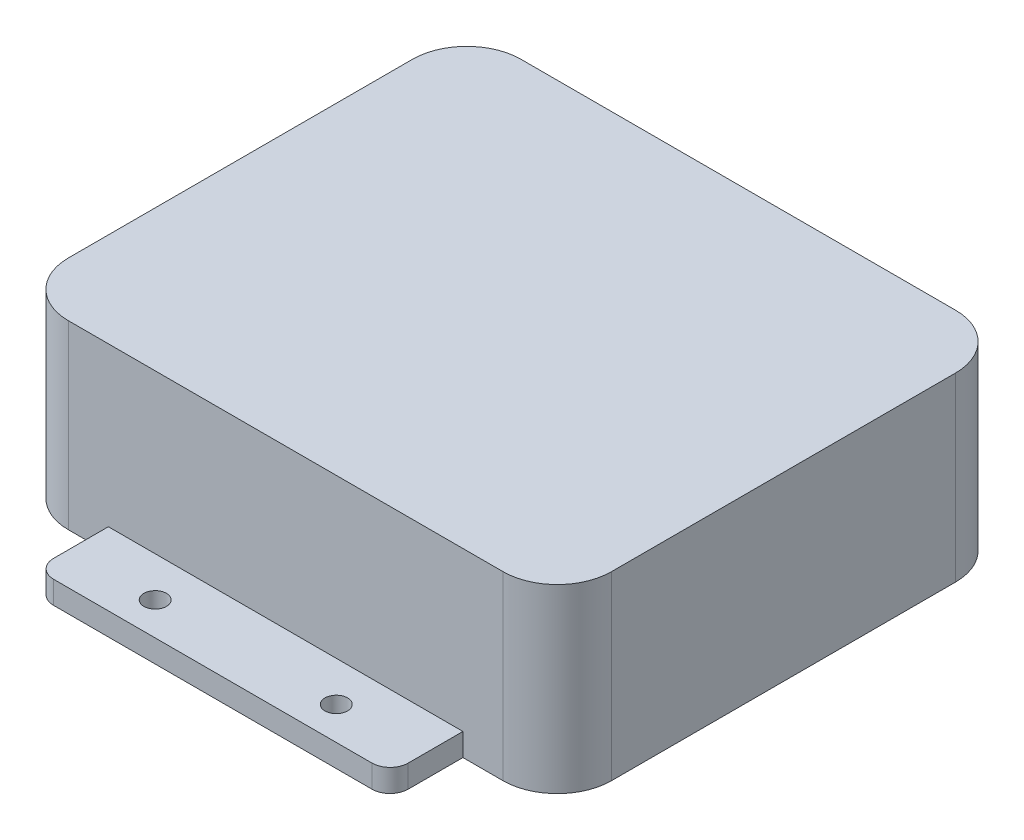
ISO-10303-21;
HEADER;
FILE_DESCRIPTION(('STEP AP214'),'2;1');
FILE_NAME('part.step','',(''),(''),'','','');
FILE_SCHEMA(('AUTOMOTIVE_DESIGN { 1 0 10303 214 1 1 1 1 }'));
ENDSEC;
DATA;
#1=APPLICATION_CONTEXT('core data for automotive mechanical design processes');
#2=APPLICATION_PROTOCOL_DEFINITION('international standard','automotive_design',2000,#1);
#3=PRODUCT_CONTEXT('',#1,'mechanical');
#4=PRODUCT('Part','Part','',(#3));
#5=PRODUCT_RELATED_PRODUCT_CATEGORY('part','',(#4));
#6=PRODUCT_DEFINITION_FORMATION('','',#4);
#7=PRODUCT_DEFINITION_CONTEXT('part definition',#1,'design');
#8=PRODUCT_DEFINITION('design','',#6,#7);
#9=PRODUCT_DEFINITION_SHAPE('','',#8);
#10=(LENGTH_UNIT() NAMED_UNIT(*) SI_UNIT(.MILLI.,.METRE.));
#11=(NAMED_UNIT(*) PLANE_ANGLE_UNIT() SI_UNIT($,.RADIAN.));
#12=(NAMED_UNIT(*) SI_UNIT($,.STERADIAN.) SOLID_ANGLE_UNIT());
#13=UNCERTAINTY_MEASURE_WITH_UNIT(LENGTH_MEASURE(1.E-05),#10,'distance_accuracy_value','');
#14=(GEOMETRIC_REPRESENTATION_CONTEXT(3) GLOBAL_UNCERTAINTY_ASSIGNED_CONTEXT((#13)) GLOBAL_UNIT_ASSIGNED_CONTEXT((#10,
#11,#12)) REPRESENTATION_CONTEXT('',''));
#15=CARTESIAN_POINT('',(0.,0.,0.));
#16=DIRECTION('',(0.,0.,1.));
#17=DIRECTION('',(1.,0.,0.));
#18=AXIS2_PLACEMENT_3D('',#15,#16,#17);
#19=CARTESIAN_POINT('',(-30.4799999999999,25.4,-31.75));
#20=DIRECTION('',(0.,0.,-1.));
#21=DIRECTION('',(-1.,0.,0.));
#22=AXIS2_PLACEMENT_3D('',#19,#20,#21);
#23=PLANE('',#22);
#24=DIRECTION('',(1.,0.,0.));
#25=VECTOR('',#24,1.);
#26=CARTESIAN_POINT('',(-30.4799999999999,0.,-31.75));
#27=LINE('',#26,#25);
#28=CARTESIAN_POINT('',(24.8694908342602,0.,-31.75));
#29=VERTEX_POINT('',#28);
#30=CARTESIAN_POINT('',(30.48,0.,-31.75));
#31=VERTEX_POINT('',#30);
#32=EDGE_CURVE('E196',#29,#31,#27,.T.);
#33=ORIENTED_EDGE('',*,*,#32,.F.);
#34=DIRECTION('',(0.,-1.,0.));
#35=VECTOR('',#34,1.);
#36=CARTESIAN_POINT('',(24.8694908342602,3.175,-31.75));
#37=LINE('',#36,#35);
#38=CARTESIAN_POINT('',(24.8694908342602,3.175,-31.75));
#39=VERTEX_POINT('',#38);
#40=EDGE_CURVE('E54',#39,#29,#37,.T.);
#41=ORIENTED_EDGE('',*,*,#40,.F.);
#42=DIRECTION('',(1.,0.,0.));
#43=VECTOR('',#42,1.);
#44=CARTESIAN_POINT('',(-24.8694908342602,3.175,-31.75));
#45=LINE('',#44,#43);
#46=CARTESIAN_POINT('',(-24.8694908342602,3.175,-31.75));
#47=VERTEX_POINT('',#46);
#48=EDGE_CURVE('E182',#47,#39,#45,.T.);
#49=ORIENTED_EDGE('',*,*,#48,.F.);
#50=DIRECTION('',(0.,-1.,0.));
#51=VECTOR('',#50,1.);
#52=CARTESIAN_POINT('',(-24.8694908342602,3.175,-31.75));
#53=LINE('',#52,#51);
#54=CARTESIAN_POINT('',(-24.8694908342602,0.,-31.75));
#55=VERTEX_POINT('',#54);
#56=EDGE_CURVE('E341',#47,#55,#53,.T.);
#57=ORIENTED_EDGE('',*,*,#56,.T.);
#58=CARTESIAN_POINT('',(-30.4799999999999,0.,-31.75));
#59=VERTEX_POINT('',#58);
#60=EDGE_CURVE('E284',#59,#55,#27,.T.);
#61=ORIENTED_EDGE('',*,*,#60,.F.);
#62=DIRECTION('',(0.,-1.,0.));
#63=VECTOR('',#62,1.);
#64=CARTESIAN_POINT('',(-30.4799999999999,25.4,-31.75));
#65=LINE('',#64,#63);
#66=CARTESIAN_POINT('',(-30.4799999999999,25.4,-31.75));
#67=VERTEX_POINT('',#66);
#68=EDGE_CURVE('E311',#67,#59,#65,.T.);
#69=ORIENTED_EDGE('',*,*,#68,.F.);
#70=DIRECTION('',(1.,0.,0.));
#71=VECTOR('',#70,1.);
#72=CARTESIAN_POINT('',(-30.4799999999999,25.4,-31.75));
#73=LINE('',#72,#71);
#74=CARTESIAN_POINT('',(30.48,25.4,-31.75));
#75=VERTEX_POINT('',#74);
#76=EDGE_CURVE('E262',#67,#75,#73,.T.);
#77=ORIENTED_EDGE('',*,*,#76,.T.);
#78=DIRECTION('',(0.,-1.,0.));
#79=VECTOR('',#78,1.);
#80=CARTESIAN_POINT('',(30.48,25.4,-31.75));
#81=LINE('',#80,#79);
#82=EDGE_CURVE('E47',#75,#31,#81,.T.);
#83=ORIENTED_EDGE('',*,*,#82,.T.);
#84=EDGE_LOOP('',(#33,#41,#49,#57,#61,#69,#77,#83));
#85=FACE_BOUND('',#84,.T.);
#86=ADVANCED_FACE('F39',(#85),#23,.T.);
#87=CARTESIAN_POINT('',(-30.4799999999999,25.4,31.75));
#88=DIRECTION('',(0.,0.,-1.));
#89=DIRECTION('',(-1.,0.,0.));
#90=AXIS2_PLACEMENT_3D('',#87,#88,#89);
#91=PLANE('',#90);
#92=DIRECTION('',(0.,-1.,0.));
#93=VECTOR('',#92,1.);
#94=CARTESIAN_POINT('',(24.8694908342602,3.175,31.75));
#95=LINE('',#94,#93);
#96=CARTESIAN_POINT('',(24.8694908342602,3.175,31.75));
#97=VERTEX_POINT('',#96);
#98=CARTESIAN_POINT('',(24.8694908342602,0.,31.75));
#99=VERTEX_POINT('',#98);
#100=EDGE_CURVE('E250',#97,#99,#95,.T.);
#101=ORIENTED_EDGE('',*,*,#100,.T.);
#102=DIRECTION('',(1.,0.,0.));
#103=VECTOR('',#102,1.);
#104=CARTESIAN_POINT('',(-30.4799999999999,0.,31.75));
#105=LINE('',#104,#103);
#106=CARTESIAN_POINT('',(30.48,0.,31.75));
#107=VERTEX_POINT('',#106);
#108=EDGE_CURVE('E296',#99,#107,#105,.T.);
#109=ORIENTED_EDGE('',*,*,#108,.T.);
#110=DIRECTION('',(0.,-1.,0.));
#111=VECTOR('',#110,1.);
#112=CARTESIAN_POINT('',(30.48,25.4,31.75));
#113=LINE('',#112,#111);
#114=CARTESIAN_POINT('',(30.48,25.4,31.75));
#115=VERTEX_POINT('',#114);
#116=EDGE_CURVE('E302',#115,#107,#113,.T.);
#117=ORIENTED_EDGE('',*,*,#116,.F.);
#118=DIRECTION('',(1.,0.,0.));
#119=VECTOR('',#118,1.);
#120=CARTESIAN_POINT('',(-30.4799999999999,25.4,31.75));
#121=LINE('',#120,#119);
#122=CARTESIAN_POINT('',(-30.4799999999999,25.4,31.75));
#123=VERTEX_POINT('',#122);
#124=EDGE_CURVE('E274',#123,#115,#121,.T.);
#125=ORIENTED_EDGE('',*,*,#124,.F.);
#126=DIRECTION('',(0.,-1.,0.));
#127=VECTOR('',#126,1.);
#128=CARTESIAN_POINT('',(-30.4799999999999,25.4,31.75));
#129=LINE('',#128,#127);
#130=CARTESIAN_POINT('',(-30.4799999999999,0.,31.75));
#131=VERTEX_POINT('',#130);
#132=EDGE_CURVE('E305',#123,#131,#129,.T.);
#133=ORIENTED_EDGE('',*,*,#132,.T.);
#134=CARTESIAN_POINT('',(-24.8694908342602,0.,31.75));
#135=VERTEX_POINT('',#134);
#136=EDGE_CURVE('E297',#131,#135,#105,.T.);
#137=ORIENTED_EDGE('',*,*,#136,.T.);
#138=DIRECTION('',(0.,-1.,0.));
#139=VECTOR('',#138,1.);
#140=CARTESIAN_POINT('',(-24.8694908342602,3.175,31.75));
#141=LINE('',#140,#139);
#142=CARTESIAN_POINT('',(-24.8694908342602,3.175,31.75));
#143=VERTEX_POINT('',#142);
#144=EDGE_CURVE('E247',#143,#135,#141,.T.);
#145=ORIENTED_EDGE('',*,*,#144,.F.);
#146=DIRECTION('',(-1.,0.,0.));
#147=VECTOR('',#146,1.);
#148=CARTESIAN_POINT('',(-24.8694908342602,3.175,31.75));
#149=LINE('',#148,#147);
#150=EDGE_CURVE('E62',#97,#143,#149,.T.);
#151=ORIENTED_EDGE('',*,*,#150,.F.);
#152=EDGE_LOOP('',(#101,#109,#117,#125,#133,#137,#145,#151));
#153=FACE_BOUND('',#152,.T.);
#154=ADVANCED_FACE('F396',(#153),#91,.F.);
#155=CARTESIAN_POINT('',(38.1,25.4,24.1299999999999));
#156=DIRECTION('',(-1.,0.,0.));
#157=DIRECTION('',(0.,0.,1.));
#158=AXIS2_PLACEMENT_3D('',#155,#156,#157);
#159=PLANE('',#158);
#160=DIRECTION('',(0.,0.,-1.));
#161=VECTOR('',#160,1.);
#162=CARTESIAN_POINT('',(38.1,0.,24.1299999999999));
#163=LINE('',#162,#161);
#164=CARTESIAN_POINT('',(38.1,0.,24.1299999999999));
#165=VERTEX_POINT('',#164);
#166=CARTESIAN_POINT('',(38.1,0.,-24.1299999999999));
#167=VERTEX_POINT('',#166);
#168=EDGE_CURVE('E255',#165,#167,#163,.T.);
#169=ORIENTED_EDGE('',*,*,#168,.T.);
#170=DIRECTION('',(0.,-1.,0.));
#171=VECTOR('',#170,1.);
#172=CARTESIAN_POINT('',(38.1,25.4,-24.1299999999999));
#173=LINE('',#172,#171);
#174=CARTESIAN_POINT('',(38.1,25.4,-24.1299999999999));
#175=VERTEX_POINT('',#174);
#176=EDGE_CURVE('E11',#175,#167,#173,.T.);
#177=ORIENTED_EDGE('',*,*,#176,.F.);
#178=DIRECTION('',(0.,0.,-1.));
#179=VECTOR('',#178,1.);
#180=CARTESIAN_POINT('',(38.1,25.4,24.1299999999999));
#181=LINE('',#180,#179);
#182=CARTESIAN_POINT('',(38.1,25.4,24.1299999999999));
#183=VERTEX_POINT('',#182);
#184=EDGE_CURVE('E256',#183,#175,#181,.T.);
#185=ORIENTED_EDGE('',*,*,#184,.F.);
#186=DIRECTION('',(0.,-1.,0.));
#187=VECTOR('',#186,1.);
#188=CARTESIAN_POINT('',(38.1,25.4,24.1299999999999));
#189=LINE('',#188,#187);
#190=EDGE_CURVE('E278',#183,#165,#189,.T.);
#191=ORIENTED_EDGE('',*,*,#190,.T.);
#192=EDGE_LOOP('',(#169,#177,#185,#191));
#193=FACE_BOUND('',#192,.T.);
#194=ADVANCED_FACE('F41',(#193),#159,.F.);
#195=CARTESIAN_POINT('',(30.48,25.4,-24.13));
#196=DIRECTION('',(0.,-1.,0.));
#197=DIRECTION('',(0.,0.,-1.));
#198=AXIS2_PLACEMENT_3D('',#195,#196,#197);
#199=CYLINDRICAL_SURFACE('',#198,7.62);
#200=CARTESIAN_POINT('',(30.48,0.,-24.13));
#201=DIRECTION('',(0.,-1.,0.));
#202=DIRECTION('',(0.,0.,-1.));
#203=AXIS2_PLACEMENT_3D('',#200,#201,#202);
#204=CIRCLE('',#203,7.62);
#205=EDGE_CURVE('E281',#31,#167,#204,.T.);
#206=ORIENTED_EDGE('',*,*,#205,.F.);
#207=ORIENTED_EDGE('',*,*,#82,.F.);
#208=CARTESIAN_POINT('',(30.48,25.4,-24.13));
#209=DIRECTION('',(0.,-1.,0.));
#210=DIRECTION('',(0.,0.,-1.));
#211=AXIS2_PLACEMENT_3D('',#208,#209,#210);
#212=CIRCLE('',#211,7.62);
#213=EDGE_CURVE('E258',#75,#175,#212,.T.);
#214=ORIENTED_EDGE('',*,*,#213,.T.);
#215=ORIENTED_EDGE('',*,*,#176,.T.);
#216=EDGE_LOOP('',(#206,#207,#214,#215));
#217=FACE_BOUND('',#216,.T.);
#218=ADVANCED_FACE('F316',(#217),#199,.T.);
#219=CARTESIAN_POINT('',(-30.48,25.4,-24.13));
#220=DIRECTION('',(0.,-1.,0.));
#221=DIRECTION('',(0.,0.,-1.));
#222=AXIS2_PLACEMENT_3D('',#219,#220,#221);
#223=CYLINDRICAL_SURFACE('',#222,7.62);
#224=CARTESIAN_POINT('',(-30.48,0.,-24.13));
#225=DIRECTION('',(0.,-1.,0.));
#226=DIRECTION('',(0.,0.,-1.));
#227=AXIS2_PLACEMENT_3D('',#224,#225,#226);
#228=CIRCLE('',#227,7.62);
#229=CARTESIAN_POINT('',(-38.1,0.,-24.1299999999999));
#230=VERTEX_POINT('',#229);
#231=EDGE_CURVE('E287',#230,#59,#228,.T.);
#232=ORIENTED_EDGE('',*,*,#231,.F.);
#233=DIRECTION('',(0.,-1.,0.));
#234=VECTOR('',#233,1.);
#235=CARTESIAN_POINT('',(-38.1,25.4,-24.1299999999999));
#236=LINE('',#235,#234);
#237=CARTESIAN_POINT('',(-38.1,25.4,-24.1299999999999));
#238=VERTEX_POINT('',#237);
#239=EDGE_CURVE('E309',#238,#230,#236,.T.);
#240=ORIENTED_EDGE('',*,*,#239,.F.);
#241=CARTESIAN_POINT('',(-30.48,25.4,-24.13));
#242=DIRECTION('',(0.,-1.,0.));
#243=DIRECTION('',(0.,0.,-1.));
#244=AXIS2_PLACEMENT_3D('',#241,#242,#243);
#245=CIRCLE('',#244,7.62);
#246=EDGE_CURVE('E265',#238,#67,#245,.T.);
#247=ORIENTED_EDGE('',*,*,#246,.T.);
#248=ORIENTED_EDGE('',*,*,#68,.T.);
#249=EDGE_LOOP('',(#232,#240,#247,#248));
#250=FACE_BOUND('',#249,.T.);
#251=ADVANCED_FACE('F403',(#250),#223,.T.);
#252=CARTESIAN_POINT('',(-38.1,25.4,24.1299999999999));
#253=DIRECTION('',(-1.,0.,0.));
#254=DIRECTION('',(0.,0.,1.));
#255=AXIS2_PLACEMENT_3D('',#252,#253,#254);
#256=PLANE('',#255);
#257=DIRECTION('',(0.,0.,-1.));
#258=VECTOR('',#257,1.);
#259=CARTESIAN_POINT('',(-38.1,0.,24.1299999999999));
#260=LINE('',#259,#258);
#261=CARTESIAN_POINT('',(-38.1,0.,24.1299999999999));
#262=VERTEX_POINT('',#261);
#263=EDGE_CURVE('E290',#262,#230,#260,.T.);
#264=ORIENTED_EDGE('',*,*,#263,.F.);
#265=DIRECTION('',(0.,-1.,0.));
#266=VECTOR('',#265,1.);
#267=CARTESIAN_POINT('',(-38.1,25.4,24.1299999999999));
#268=LINE('',#267,#266);
#269=CARTESIAN_POINT('',(-38.1,25.4,24.1299999999999));
#270=VERTEX_POINT('',#269);
#271=EDGE_CURVE('E307',#270,#262,#268,.T.);
#272=ORIENTED_EDGE('',*,*,#271,.F.);
#273=DIRECTION('',(0.,0.,-1.));
#274=VECTOR('',#273,1.);
#275=CARTESIAN_POINT('',(-38.1,25.4,24.1299999999999));
#276=LINE('',#275,#274);
#277=EDGE_CURVE('E268',#270,#238,#276,.T.);
#278=ORIENTED_EDGE('',*,*,#277,.T.);
#279=ORIENTED_EDGE('',*,*,#239,.T.);
#280=EDGE_LOOP('',(#264,#272,#278,#279));
#281=FACE_BOUND('',#280,.T.);
#282=ADVANCED_FACE('F410',(#281),#256,.T.);
#283=CARTESIAN_POINT('',(-30.48,25.4,24.13));
#284=DIRECTION('',(0.,-1.,0.));
#285=DIRECTION('',(0.,0.,-1.));
#286=AXIS2_PLACEMENT_3D('',#283,#284,#285);
#287=CYLINDRICAL_SURFACE('',#286,7.62);
#288=CARTESIAN_POINT('',(-30.48,0.,24.13));
#289=DIRECTION('',(0.,-1.,0.));
#290=DIRECTION('',(0.,0.,-1.));
#291=AXIS2_PLACEMENT_3D('',#288,#289,#290);
#292=CIRCLE('',#291,7.62);
#293=EDGE_CURVE('E293',#131,#262,#292,.T.);
#294=ORIENTED_EDGE('',*,*,#293,.F.);
#295=ORIENTED_EDGE('',*,*,#132,.F.);
#296=CARTESIAN_POINT('',(-30.48,25.4,24.13));
#297=DIRECTION('',(0.,-1.,0.));
#298=DIRECTION('',(0.,0.,-1.));
#299=AXIS2_PLACEMENT_3D('',#296,#297,#298);
#300=CIRCLE('',#299,7.62);
#301=EDGE_CURVE('E271',#123,#270,#300,.T.);
#302=ORIENTED_EDGE('',*,*,#301,.T.);
#303=ORIENTED_EDGE('',*,*,#271,.T.);
#304=EDGE_LOOP('',(#294,#295,#302,#303));
#305=FACE_BOUND('',#304,.T.);
#306=ADVANCED_FACE('F447',(#305),#287,.T.);
#307=CARTESIAN_POINT('',(30.48,25.4,24.13));
#308=DIRECTION('',(0.,-1.,0.));
#309=DIRECTION('',(0.,0.,-1.));
#310=AXIS2_PLACEMENT_3D('',#307,#308,#309);
#311=CYLINDRICAL_SURFACE('',#310,7.62);
#312=CARTESIAN_POINT('',(30.48,0.,24.13));
#313=DIRECTION('',(0.,1.,0.));
#314=DIRECTION('',(0.,0.,1.));
#315=AXIS2_PLACEMENT_3D('',#312,#313,#314);
#316=CIRCLE('',#315,7.62);
#317=EDGE_CURVE('E259',#107,#165,#316,.T.);
#318=ORIENTED_EDGE('',*,*,#317,.T.);
#319=ORIENTED_EDGE('',*,*,#190,.F.);
#320=CARTESIAN_POINT('',(30.48,25.4,24.13));
#321=DIRECTION('',(0.,1.,0.));
#322=DIRECTION('',(0.,0.,1.));
#323=AXIS2_PLACEMENT_3D('',#320,#321,#322);
#324=CIRCLE('',#323,7.62);
#325=EDGE_CURVE('E276',#115,#183,#324,.T.);
#326=ORIENTED_EDGE('',*,*,#325,.F.);
#327=ORIENTED_EDGE('',*,*,#116,.T.);
#328=EDGE_LOOP('',(#318,#319,#326,#327));
#329=FACE_BOUND('',#328,.T.);
#330=ADVANCED_FACE('F419',(#329),#311,.T.);
#331=CARTESIAN_POINT('',(30.48,25.4,-24.13));
#332=DIRECTION('',(0.,-1.,0.));
#333=DIRECTION('',(0.,0.,-1.));
#334=AXIS2_PLACEMENT_3D('',#331,#332,#333);
#335=PLANE('',#334);
#336=ORIENTED_EDGE('',*,*,#184,.T.);
#337=ORIENTED_EDGE('',*,*,#213,.F.);
#338=ORIENTED_EDGE('',*,*,#76,.F.);
#339=ORIENTED_EDGE('',*,*,#246,.F.);
#340=ORIENTED_EDGE('',*,*,#277,.F.);
#341=ORIENTED_EDGE('',*,*,#301,.F.);
#342=ORIENTED_EDGE('',*,*,#124,.T.);
#343=ORIENTED_EDGE('',*,*,#325,.T.);
#344=EDGE_LOOP('',(#336,#337,#338,#339,#340,#341,#342,#343));
#345=FACE_BOUND('',#344,.T.);
#346=ADVANCED_FACE('F457',(#345),#335,.F.);
#347=CARTESIAN_POINT('',(30.48,0.,-24.13));
#348=DIRECTION('',(0.,-1.,0.));
#349=DIRECTION('',(0.,0.,-1.));
#350=AXIS2_PLACEMENT_3D('',#347,#348,#349);
#351=PLANE('',#350);
#352=ORIENTED_EDGE('',*,*,#168,.F.);
#353=ORIENTED_EDGE('',*,*,#317,.F.);
#354=ORIENTED_EDGE('',*,*,#108,.F.);
#355=DIRECTION('',(0.,0.,-1.));
#356=VECTOR('',#355,1.);
#357=CARTESIAN_POINT('',(24.8694908342602,0.,31.75));
#358=LINE('',#357,#356);
#359=CARTESIAN_POINT('',(24.8694908342602,0.,39.431167642027));
#360=VERTEX_POINT('',#359);
#361=EDGE_CURVE('E231',#360,#99,#358,.T.);
#362=ORIENTED_EDGE('',*,*,#361,.F.);
#363=CARTESIAN_POINT('',(22.3294908342602,0.,39.431167642027));
#364=DIRECTION('',(0.,1.,0.));
#365=DIRECTION('',(0.,0.,-1.));
#366=AXIS2_PLACEMENT_3D('',#363,#364,#365);
#367=CIRCLE('',#366,2.54);
#368=CARTESIAN_POINT('',(22.3294908342602,0.,41.971167642027));
#369=VERTEX_POINT('',#368);
#370=EDGE_CURVE('E212',#369,#360,#367,.T.);
#371=ORIENTED_EDGE('',*,*,#370,.F.);
#372=DIRECTION('',(1.,0.,0.));
#373=VECTOR('',#372,1.);
#374=CARTESIAN_POINT('',(-22.3294908342602,0.,41.971167642027));
#375=LINE('',#374,#373);
#376=CARTESIAN_POINT('',(-22.3294908342602,0.,41.971167642027));
#377=VERTEX_POINT('',#376);
#378=EDGE_CURVE('E219',#377,#369,#375,.T.);
#379=ORIENTED_EDGE('',*,*,#378,.F.);
#380=CARTESIAN_POINT('',(-22.3294908342602,0.,39.431167642027));
#381=DIRECTION('',(0.,1.,0.));
#382=DIRECTION('',(0.,0.,-1.));
#383=AXIS2_PLACEMENT_3D('',#380,#381,#382);
#384=CIRCLE('',#383,2.54);
#385=CARTESIAN_POINT('',(-24.8694908342602,0.,39.431167642027));
#386=VERTEX_POINT('',#385);
#387=EDGE_CURVE('E236',#386,#377,#384,.T.);
#388=ORIENTED_EDGE('',*,*,#387,.F.);
#389=DIRECTION('',(0.,0.,1.));
#390=VECTOR('',#389,1.);
#391=CARTESIAN_POINT('',(-24.8694908342602,0.,31.75));
#392=LINE('',#391,#390);
#393=EDGE_CURVE('E234',#135,#386,#392,.T.);
#394=ORIENTED_EDGE('',*,*,#393,.F.);
#395=ORIENTED_EDGE('',*,*,#136,.F.);
#396=ORIENTED_EDGE('',*,*,#293,.T.);
#397=ORIENTED_EDGE('',*,*,#263,.T.);
#398=ORIENTED_EDGE('',*,*,#231,.T.);
#399=ORIENTED_EDGE('',*,*,#60,.T.);
#400=DIRECTION('',(0.,0.,1.));
#401=VECTOR('',#400,1.);
#402=CARTESIAN_POINT('',(-24.8694908342602,0.,-31.75));
#403=LINE('',#402,#401);
#404=CARTESIAN_POINT('',(-24.8694908342602,0.,-39.431167642027));
#405=VERTEX_POINT('',#404);
#406=EDGE_CURVE('E192',#405,#55,#403,.T.);
#407=ORIENTED_EDGE('',*,*,#406,.F.);
#408=CARTESIAN_POINT('',(-22.3294908342602,0.,-39.431167642027));
#409=DIRECTION('',(0.,1.,0.));
#410=DIRECTION('',(0.,0.,1.));
#411=AXIS2_PLACEMENT_3D('',#408,#409,#410);
#412=CIRCLE('',#411,2.54);
#413=CARTESIAN_POINT('',(-22.3294908342602,0.,-41.971167642027));
#414=VERTEX_POINT('',#413);
#415=EDGE_CURVE('E338',#414,#405,#412,.T.);
#416=ORIENTED_EDGE('',*,*,#415,.F.);
#417=DIRECTION('',(-1.,0.,0.));
#418=VECTOR('',#417,1.);
#419=CARTESIAN_POINT('',(-22.3294908342602,0.,-41.971167642027));
#420=LINE('',#419,#418);
#421=CARTESIAN_POINT('',(22.3294908342602,0.,-41.971167642027));
#422=VERTEX_POINT('',#421);
#423=EDGE_CURVE('E329',#422,#414,#420,.T.);
#424=ORIENTED_EDGE('',*,*,#423,.F.);
#425=CARTESIAN_POINT('',(22.3294908342602,0.,-39.431167642027));
#426=DIRECTION('',(0.,1.,0.));
#427=DIRECTION('',(0.,0.,1.));
#428=AXIS2_PLACEMENT_3D('',#425,#426,#427);
#429=CIRCLE('',#428,2.54);
#430=CARTESIAN_POINT('',(24.8694908342602,0.,-39.431167642027));
#431=VERTEX_POINT('',#430);
#432=EDGE_CURVE('E326',#431,#422,#429,.T.);
#433=ORIENTED_EDGE('',*,*,#432,.F.);
#434=DIRECTION('',(0.,0.,-1.));
#435=VECTOR('',#434,1.);
#436=CARTESIAN_POINT('',(24.8694908342602,0.,-31.75));
#437=LINE('',#436,#435);
#438=EDGE_CURVE('E324',#29,#431,#437,.T.);
#439=ORIENTED_EDGE('',*,*,#438,.F.);
#440=ORIENTED_EDGE('',*,*,#32,.T.);
#441=ORIENTED_EDGE('',*,*,#205,.T.);
#442=EDGE_LOOP('',(#352,#353,#354,#362,#371,#379,#388,#394,#395,#396,#397,#398,#399,#407,#416,
#424,#433,#439,#440,#441));
#443=FACE_BOUND('',#442,.T.);
#444=CARTESIAN_POINT('',(12.7,0.,37.35));
#445=DIRECTION('',(0.,1.,0.));
#446=DIRECTION('',(0.,0.,1.));
#447=AXIS2_PLACEMENT_3D('',#444,#445,#446);
#448=CIRCLE('',#447,1.5875);
#449=CARTESIAN_POINT('',(12.7,0.,38.9375));
#450=VERTEX_POINT('',#449);
#451=EDGE_CURVE('E207',#450,#450,#448,.T.);
#452=ORIENTED_EDGE('',*,*,#451,.T.);
#453=EDGE_LOOP('',(#452));
#454=FACE_BOUND('',#453,.T.);
#455=CARTESIAN_POINT('',(-12.7,0.,37.35));
#456=DIRECTION('',(0.,1.,0.));
#457=DIRECTION('',(0.,0.,-1.));
#458=AXIS2_PLACEMENT_3D('',#455,#456,#457);
#459=CIRCLE('',#458,1.5875);
#460=CARTESIAN_POINT('',(-12.7,0.,35.7625));
#461=VERTEX_POINT('',#460);
#462=EDGE_CURVE('E197',#461,#461,#459,.T.);
#463=ORIENTED_EDGE('',*,*,#462,.T.);
#464=EDGE_LOOP('',(#463));
#465=FACE_BOUND('',#464,.T.);
#466=CARTESIAN_POINT('',(12.7,0.,-37.35));
#467=DIRECTION('',(0.,1.,0.));
#468=DIRECTION('',(0.,0.,-1.));
#469=AXIS2_PLACEMENT_3D('',#466,#467,#468);
#470=CIRCLE('',#469,1.5875);
#471=CARTESIAN_POINT('',(12.7,0.,-38.9375));
#472=VERTEX_POINT('',#471);
#473=EDGE_CURVE('E332',#472,#472,#470,.T.);
#474=ORIENTED_EDGE('',*,*,#473,.T.);
#475=EDGE_LOOP('',(#474));
#476=FACE_BOUND('',#475,.T.);
#477=CARTESIAN_POINT('',(-12.7,0.,-37.35));
#478=DIRECTION('',(0.,1.,0.));
#479=DIRECTION('',(0.,0.,1.));
#480=AXIS2_PLACEMENT_3D('',#477,#478,#479);
#481=CIRCLE('',#480,1.5875);
#482=CARTESIAN_POINT('',(-12.7,0.,-35.7625));
#483=VERTEX_POINT('',#482);
#484=EDGE_CURVE('E371',#483,#483,#481,.T.);
#485=ORIENTED_EDGE('',*,*,#484,.T.);
#486=EDGE_LOOP('',(#485));
#487=FACE_BOUND('',#486,.T.);
#488=ADVANCED_FACE('F320',(#443,#454,#465,#476,#487),#351,.T.);
#489=CARTESIAN_POINT('',(22.3294908342602,3.175,39.431167642027));
#490=DIRECTION('',(0.,-1.,0.));
#491=DIRECTION('',(0.,0.,-1.));
#492=AXIS2_PLACEMENT_3D('',#489,#490,#491);
#493=PLANE('',#492);
#494=CARTESIAN_POINT('',(22.3294908342602,3.175,39.431167642027));
#495=DIRECTION('',(0.,1.,0.));
#496=DIRECTION('',(0.,0.,-1.));
#497=AXIS2_PLACEMENT_3D('',#494,#495,#496);
#498=CIRCLE('',#497,2.54);
#499=CARTESIAN_POINT('',(22.3294908342602,3.175,41.971167642027));
#500=VERTEX_POINT('',#499);
#501=CARTESIAN_POINT('',(24.8694908342602,3.175,39.431167642027));
#502=VERTEX_POINT('',#501);
#503=EDGE_CURVE('E215',#500,#502,#498,.T.);
#504=ORIENTED_EDGE('',*,*,#503,.T.);
#505=DIRECTION('',(0.,0.,-1.));
#506=VECTOR('',#505,1.);
#507=CARTESIAN_POINT('',(24.8694908342602,3.175,31.75));
#508=LINE('',#507,#506);
#509=EDGE_CURVE('E218',#502,#97,#508,.T.);
#510=ORIENTED_EDGE('',*,*,#509,.T.);
#511=ORIENTED_EDGE('',*,*,#150,.T.);
#512=DIRECTION('',(0.,0.,1.));
#513=VECTOR('',#512,1.);
#514=CARTESIAN_POINT('',(-24.8694908342602,3.175,31.75));
#515=LINE('',#514,#513);
#516=CARTESIAN_POINT('',(-24.8694908342602,3.175,39.431167642027));
#517=VERTEX_POINT('',#516);
#518=EDGE_CURVE('E222',#143,#517,#515,.T.);
#519=ORIENTED_EDGE('',*,*,#518,.T.);
#520=CARTESIAN_POINT('',(-22.3294908342602,3.175,39.431167642027));
#521=DIRECTION('',(0.,1.,0.));
#522=DIRECTION('',(0.,0.,-1.));
#523=AXIS2_PLACEMENT_3D('',#520,#521,#522);
#524=CIRCLE('',#523,2.54);
#525=CARTESIAN_POINT('',(-22.3294908342602,3.175,41.971167642027));
#526=VERTEX_POINT('',#525);
#527=EDGE_CURVE('E224',#517,#526,#524,.T.);
#528=ORIENTED_EDGE('',*,*,#527,.T.);
#529=DIRECTION('',(1.,0.,0.));
#530=VECTOR('',#529,1.);
#531=CARTESIAN_POINT('',(-22.3294908342602,3.175,41.971167642027));
#532=LINE('',#531,#530);
#533=EDGE_CURVE('E226',#526,#500,#532,.T.);
#534=ORIENTED_EDGE('',*,*,#533,.T.);
#535=EDGE_LOOP('',(#504,#510,#511,#519,#528,#534));
#536=FACE_BOUND('',#535,.T.);
#537=CARTESIAN_POINT('',(12.7,3.175,37.35));
#538=DIRECTION('',(0.,1.,0.));
#539=DIRECTION('',(0.,0.,1.));
#540=AXIS2_PLACEMENT_3D('',#537,#538,#539);
#541=CIRCLE('',#540,1.5875);
#542=CARTESIAN_POINT('',(12.7,3.175,38.9375));
#543=VERTEX_POINT('',#542);
#544=EDGE_CURVE('E209',#543,#543,#541,.T.);
#545=ORIENTED_EDGE('',*,*,#544,.F.);
#546=EDGE_LOOP('',(#545));
#547=FACE_BOUND('',#546,.T.);
#548=CARTESIAN_POINT('',(-12.7,3.175,37.35));
#549=DIRECTION('',(0.,1.,0.));
#550=DIRECTION('',(0.,0.,-1.));
#551=AXIS2_PLACEMENT_3D('',#548,#549,#550);
#552=CIRCLE('',#551,1.5875);
#553=CARTESIAN_POINT('',(-12.7,3.175,35.7625));
#554=VERTEX_POINT('',#553);
#555=EDGE_CURVE('E200',#554,#554,#552,.T.);
#556=ORIENTED_EDGE('',*,*,#555,.F.);
#557=EDGE_LOOP('',(#556));
#558=FACE_BOUND('',#557,.T.);
#559=ADVANCED_FACE('F464',(#536,#547,#558),#493,.F.);
#560=CARTESIAN_POINT('',(22.3294908342602,3.175,39.431167642027));
#561=DIRECTION('',(0.,-1.,0.));
#562=DIRECTION('',(0.,0.,-1.));
#563=AXIS2_PLACEMENT_3D('',#560,#561,#562);
#564=CYLINDRICAL_SURFACE('',#563,2.54);
#565=ORIENTED_EDGE('',*,*,#370,.T.);
#566=DIRECTION('',(0.,-1.,0.));
#567=VECTOR('',#566,1.);
#568=CARTESIAN_POINT('',(24.8694908342602,3.175,39.431167642027));
#569=LINE('',#568,#567);
#570=EDGE_CURVE('E252',#502,#360,#569,.T.);
#571=ORIENTED_EDGE('',*,*,#570,.F.);
#572=ORIENTED_EDGE('',*,*,#503,.F.);
#573=DIRECTION('',(0.,-1.,0.));
#574=VECTOR('',#573,1.);
#575=CARTESIAN_POINT('',(22.3294908342602,3.175,41.971167642027));
#576=LINE('',#575,#574);
#577=EDGE_CURVE('E228',#500,#369,#576,.T.);
#578=ORIENTED_EDGE('',*,*,#577,.T.);
#579=EDGE_LOOP('',(#565,#571,#572,#578));
#580=FACE_BOUND('',#579,.T.);
#581=ADVANCED_FACE('F428',(#580),#564,.T.);
#582=CARTESIAN_POINT('',(24.8694908342602,3.175,31.75));
#583=DIRECTION('',(-1.,0.,0.));
#584=DIRECTION('',(0.,0.,1.));
#585=AXIS2_PLACEMENT_3D('',#582,#583,#584);
#586=PLANE('',#585);
#587=ORIENTED_EDGE('',*,*,#361,.T.);
#588=ORIENTED_EDGE('',*,*,#100,.F.);
#589=ORIENTED_EDGE('',*,*,#509,.F.);
#590=ORIENTED_EDGE('',*,*,#570,.T.);
#591=EDGE_LOOP('',(#587,#588,#589,#590));
#592=FACE_BOUND('',#591,.T.);
#593=ADVANCED_FACE('F424',(#592),#586,.F.);
#594=CARTESIAN_POINT('',(-24.8694908342602,3.175,31.75));
#595=DIRECTION('',(1.,0.,0.));
#596=DIRECTION('',(0.,0.,-1.));
#597=AXIS2_PLACEMENT_3D('',#594,#595,#596);
#598=PLANE('',#597);
#599=ORIENTED_EDGE('',*,*,#393,.T.);
#600=DIRECTION('',(0.,-1.,0.));
#601=VECTOR('',#600,1.);
#602=CARTESIAN_POINT('',(-24.8694908342602,3.175,39.431167642027));
#603=LINE('',#602,#601);
#604=EDGE_CURVE('E244',#517,#386,#603,.T.);
#605=ORIENTED_EDGE('',*,*,#604,.F.);
#606=ORIENTED_EDGE('',*,*,#518,.F.);
#607=ORIENTED_EDGE('',*,*,#144,.T.);
#608=EDGE_LOOP('',(#599,#605,#606,#607));
#609=FACE_BOUND('',#608,.T.);
#610=ADVANCED_FACE('F443',(#609),#598,.F.);
#611=CARTESIAN_POINT('',(-22.3294908342602,3.175,39.431167642027));
#612=DIRECTION('',(0.,-1.,0.));
#613=DIRECTION('',(0.,0.,-1.));
#614=AXIS2_PLACEMENT_3D('',#611,#612,#613);
#615=CYLINDRICAL_SURFACE('',#614,2.54);
#616=ORIENTED_EDGE('',*,*,#387,.T.);
#617=DIRECTION('',(0.,-1.,0.));
#618=VECTOR('',#617,1.);
#619=CARTESIAN_POINT('',(-22.3294908342602,3.175,41.971167642027));
#620=LINE('',#619,#618);
#621=EDGE_CURVE('E241',#526,#377,#620,.T.);
#622=ORIENTED_EDGE('',*,*,#621,.F.);
#623=ORIENTED_EDGE('',*,*,#527,.F.);
#624=ORIENTED_EDGE('',*,*,#604,.T.);
#625=EDGE_LOOP('',(#616,#622,#623,#624));
#626=FACE_BOUND('',#625,.T.);
#627=ADVANCED_FACE('F439',(#626),#615,.T.);
#628=CARTESIAN_POINT('',(-22.3294908342602,3.175,41.971167642027));
#629=DIRECTION('',(0.,0.,-1.));
#630=DIRECTION('',(-1.,0.,0.));
#631=AXIS2_PLACEMENT_3D('',#628,#629,#630);
#632=PLANE('',#631);
#633=ORIENTED_EDGE('',*,*,#378,.T.);
#634=ORIENTED_EDGE('',*,*,#577,.F.);
#635=ORIENTED_EDGE('',*,*,#533,.F.);
#636=ORIENTED_EDGE('',*,*,#621,.T.);
#637=EDGE_LOOP('',(#633,#634,#635,#636));
#638=FACE_BOUND('',#637,.T.);
#639=ADVANCED_FACE('F434',(#638),#632,.F.);
#640=CARTESIAN_POINT('',(12.7,3.175,37.35));
#641=DIRECTION('',(0.,-1.,0.));
#642=DIRECTION('',(0.,0.,-1.));
#643=AXIS2_PLACEMENT_3D('',#640,#641,#642);
#644=CYLINDRICAL_SURFACE('',#643,1.5875);
#645=ORIENTED_EDGE('',*,*,#544,.T.);
#646=EDGE_LOOP('',(#645));
#647=FACE_BOUND('',#646,.T.);
#648=ORIENTED_EDGE('',*,*,#451,.F.);
#649=EDGE_LOOP('',(#648));
#650=FACE_BOUND('',#649,.T.);
#651=ADVANCED_FACE('F389',(#647,#650),#644,.F.);
#652=CARTESIAN_POINT('',(-12.7,3.175,37.35));
#653=DIRECTION('',(0.,-1.,0.));
#654=DIRECTION('',(0.,0.,-1.));
#655=AXIS2_PLACEMENT_3D('',#652,#653,#654);
#656=CYLINDRICAL_SURFACE('',#655,1.5875);
#657=ORIENTED_EDGE('',*,*,#555,.T.);
#658=EDGE_LOOP('',(#657));
#659=FACE_BOUND('',#658,.T.);
#660=ORIENTED_EDGE('',*,*,#462,.F.);
#661=EDGE_LOOP('',(#660));
#662=FACE_BOUND('',#661,.T.);
#663=ADVANCED_FACE('F380',(#659,#662),#656,.F.);
#664=CARTESIAN_POINT('',(22.3294908342602,3.175,-39.431167642027));
#665=DIRECTION('',(0.,1.,0.));
#666=DIRECTION('',(0.,0.,1.));
#667=AXIS2_PLACEMENT_3D('',#664,#665,#666);
#668=PLANE('',#667);
#669=CARTESIAN_POINT('',(12.7,3.175,-37.35));
#670=DIRECTION('',(0.,1.,0.));
#671=DIRECTION('',(0.,0.,-1.));
#672=AXIS2_PLACEMENT_3D('',#669,#670,#671);
#673=CIRCLE('',#672,1.5875);
#674=CARTESIAN_POINT('',(12.7,3.175,-38.9375));
#675=VERTEX_POINT('',#674);
#676=EDGE_CURVE('E327',#675,#675,#673,.T.);
#677=ORIENTED_EDGE('',*,*,#676,.F.);
#678=EDGE_LOOP('',(#677));
#679=FACE_BOUND('',#678,.T.);
#680=ORIENTED_EDGE('',*,*,#48,.T.);
#681=DIRECTION('',(0.,0.,-1.));
#682=VECTOR('',#681,1.);
#683=CARTESIAN_POINT('',(24.8694908342602,3.175,-31.75));
#684=LINE('',#683,#682);
#685=CARTESIAN_POINT('',(24.8694908342602,3.175,-39.431167642027));
#686=VERTEX_POINT('',#685);
#687=EDGE_CURVE('E174',#39,#686,#684,.T.);
#688=ORIENTED_EDGE('',*,*,#687,.T.);
#689=CARTESIAN_POINT('',(22.3294908342602,3.175,-39.431167642027));
#690=DIRECTION('',(0.,1.,0.));
#691=DIRECTION('',(0.,0.,1.));
#692=AXIS2_PLACEMENT_3D('',#689,#690,#691);
#693=CIRCLE('',#692,2.54);
#694=CARTESIAN_POINT('',(22.3294908342602,3.175,-41.971167642027));
#695=VERTEX_POINT('',#694);
#696=EDGE_CURVE('E181',#686,#695,#693,.T.);
#697=ORIENTED_EDGE('',*,*,#696,.T.);
#698=DIRECTION('',(-1.,0.,0.));
#699=VECTOR('',#698,1.);
#700=CARTESIAN_POINT('',(-22.3294908342602,3.175,-41.971167642027));
#701=LINE('',#700,#699);
#702=CARTESIAN_POINT('',(-22.3294908342602,3.175,-41.971167642027));
#703=VERTEX_POINT('',#702);
#704=EDGE_CURVE('E354',#695,#703,#701,.T.);
#705=ORIENTED_EDGE('',*,*,#704,.T.);
#706=CARTESIAN_POINT('',(-22.3294908342602,3.175,-39.431167642027));
#707=DIRECTION('',(0.,1.,0.));
#708=DIRECTION('',(0.,0.,1.));
#709=AXIS2_PLACEMENT_3D('',#706,#707,#708);
#710=CIRCLE('',#709,2.54);
#711=CARTESIAN_POINT('',(-24.8694908342602,3.175,-39.431167642027));
#712=VERTEX_POINT('',#711);
#713=EDGE_CURVE('E364',#703,#712,#710,.T.);
#714=ORIENTED_EDGE('',*,*,#713,.T.);
#715=DIRECTION('',(0.,0.,1.));
#716=VECTOR('',#715,1.);
#717=CARTESIAN_POINT('',(-24.8694908342602,3.175,-31.75));
#718=LINE('',#717,#716);
#719=EDGE_CURVE('E188',#712,#47,#718,.T.);
#720=ORIENTED_EDGE('',*,*,#719,.T.);
#721=EDGE_LOOP('',(#680,#688,#697,#705,#714,#720));
#722=FACE_BOUND('',#721,.T.);
#723=CARTESIAN_POINT('',(-12.7,3.175,-37.35));
#724=DIRECTION('',(0.,1.,0.));
#725=DIRECTION('',(0.,0.,1.));
#726=AXIS2_PLACEMENT_3D('',#723,#724,#725);
#727=CIRCLE('',#726,1.5875);
#728=CARTESIAN_POINT('',(-12.7,3.175,-35.7625));
#729=VERTEX_POINT('',#728);
#730=EDGE_CURVE('E369',#729,#729,#727,.T.);
#731=ORIENTED_EDGE('',*,*,#730,.F.);
#732=EDGE_LOOP('',(#731));
#733=FACE_BOUND('',#732,.T.);
#734=ADVANCED_FACE('F185',(#679,#722,#733),#668,.T.);
#735=CARTESIAN_POINT('',(24.8694908342602,3.175,-31.75));
#736=DIRECTION('',(-1.,0.,0.));
#737=DIRECTION('',(0.,0.,1.));
#738=AXIS2_PLACEMENT_3D('',#735,#736,#737);
#739=PLANE('',#738);
#740=ORIENTED_EDGE('',*,*,#438,.T.);
#741=DIRECTION('',(0.,-1.,0.));
#742=VECTOR('',#741,1.);
#743=CARTESIAN_POINT('',(24.8694908342602,3.175,-39.431167642027));
#744=LINE('',#743,#742);
#745=EDGE_CURVE('E178',#686,#431,#744,.T.);
#746=ORIENTED_EDGE('',*,*,#745,.F.);
#747=ORIENTED_EDGE('',*,*,#687,.F.);
#748=ORIENTED_EDGE('',*,*,#40,.T.);
#749=EDGE_LOOP('',(#740,#746,#747,#748));
#750=FACE_BOUND('',#749,.T.);
#751=ADVANCED_FACE('F176',(#750),#739,.F.);
#752=CARTESIAN_POINT('',(22.3294908342602,3.175,-39.431167642027));
#753=DIRECTION('',(0.,-1.,0.));
#754=DIRECTION('',(0.,0.,-1.));
#755=AXIS2_PLACEMENT_3D('',#752,#753,#754);
#756=CYLINDRICAL_SURFACE('',#755,2.54);
#757=ORIENTED_EDGE('',*,*,#432,.T.);
#758=DIRECTION('',(0.,-1.,0.));
#759=VECTOR('',#758,1.);
#760=CARTESIAN_POINT('',(22.3294908342602,3.175,-41.971167642027));
#761=LINE('',#760,#759);
#762=EDGE_CURVE('E202',#695,#422,#761,.T.);
#763=ORIENTED_EDGE('',*,*,#762,.F.);
#764=ORIENTED_EDGE('',*,*,#696,.F.);
#765=ORIENTED_EDGE('',*,*,#745,.T.);
#766=EDGE_LOOP('',(#757,#763,#764,#765));
#767=FACE_BOUND('',#766,.T.);
#768=ADVANCED_FACE('F387',(#767),#756,.T.);
#769=CARTESIAN_POINT('',(-22.3294908342602,3.175,-41.971167642027));
#770=DIRECTION('',(0.,0.,1.));
#771=DIRECTION('',(1.,0.,0.));
#772=AXIS2_PLACEMENT_3D('',#769,#770,#771);
#773=PLANE('',#772);
#774=ORIENTED_EDGE('',*,*,#423,.T.);
#775=DIRECTION('',(0.,-1.,0.));
#776=VECTOR('',#775,1.);
#777=CARTESIAN_POINT('',(-22.3294908342602,3.175,-41.971167642027));
#778=LINE('',#777,#776);
#779=EDGE_CURVE('E346',#703,#414,#778,.T.);
#780=ORIENTED_EDGE('',*,*,#779,.F.);
#781=ORIENTED_EDGE('',*,*,#704,.F.);
#782=ORIENTED_EDGE('',*,*,#762,.T.);
#783=EDGE_LOOP('',(#774,#780,#781,#782));
#784=FACE_BOUND('',#783,.T.);
#785=ADVANCED_FACE('F352',(#784),#773,.F.);
#786=CARTESIAN_POINT('',(-22.3294908342602,3.175,-39.431167642027));
#787=DIRECTION('',(0.,-1.,0.));
#788=DIRECTION('',(0.,0.,-1.));
#789=AXIS2_PLACEMENT_3D('',#786,#787,#788);
#790=CYLINDRICAL_SURFACE('',#789,2.54);
#791=ORIENTED_EDGE('',*,*,#415,.T.);
#792=DIRECTION('',(0.,-1.,0.));
#793=VECTOR('',#792,1.);
#794=CARTESIAN_POINT('',(-24.8694908342602,3.175,-39.431167642027));
#795=LINE('',#794,#793);
#796=EDGE_CURVE('E343',#712,#405,#795,.T.);
#797=ORIENTED_EDGE('',*,*,#796,.F.);
#798=ORIENTED_EDGE('',*,*,#713,.F.);
#799=ORIENTED_EDGE('',*,*,#779,.T.);
#800=EDGE_LOOP('',(#791,#797,#798,#799));
#801=FACE_BOUND('',#800,.T.);
#802=ADVANCED_FACE('F360',(#801),#790,.T.);
#803=CARTESIAN_POINT('',(-24.8694908342602,3.175,-31.75));
#804=DIRECTION('',(1.,0.,0.));
#805=DIRECTION('',(0.,0.,-1.));
#806=AXIS2_PLACEMENT_3D('',#803,#804,#805);
#807=PLANE('',#806);
#808=ORIENTED_EDGE('',*,*,#406,.T.);
#809=ORIENTED_EDGE('',*,*,#56,.F.);
#810=ORIENTED_EDGE('',*,*,#719,.F.);
#811=ORIENTED_EDGE('',*,*,#796,.T.);
#812=EDGE_LOOP('',(#808,#809,#810,#811));
#813=FACE_BOUND('',#812,.T.);
#814=ADVANCED_FACE('F363',(#813),#807,.F.);
#815=CARTESIAN_POINT('',(12.7,3.175,-37.35));
#816=DIRECTION('',(0.,-1.,0.));
#817=DIRECTION('',(0.,0.,-1.));
#818=AXIS2_PLACEMENT_3D('',#815,#816,#817);
#819=CYLINDRICAL_SURFACE('',#818,1.5875);
#820=ORIENTED_EDGE('',*,*,#676,.T.);
#821=EDGE_LOOP('',(#820));
#822=FACE_BOUND('',#821,.T.);
#823=ORIENTED_EDGE('',*,*,#473,.F.);
#824=EDGE_LOOP('',(#823));
#825=FACE_BOUND('',#824,.T.);
#826=ADVANCED_FACE('F624',(#822,#825),#819,.F.);
#827=CARTESIAN_POINT('',(-12.7,3.175,-37.35));
#828=DIRECTION('',(0.,-1.,0.));
#829=DIRECTION('',(0.,0.,-1.));
#830=AXIS2_PLACEMENT_3D('',#827,#828,#829);
#831=CYLINDRICAL_SURFACE('',#830,1.5875);
#832=ORIENTED_EDGE('',*,*,#730,.T.);
#833=EDGE_LOOP('',(#832));
#834=FACE_BOUND('',#833,.T.);
#835=ORIENTED_EDGE('',*,*,#484,.F.);
#836=EDGE_LOOP('',(#835));
#837=FACE_BOUND('',#836,.T.);
#838=ADVANCED_FACE('F377',(#834,#837),#831,.F.);
#839=CLOSED_SHELL('',(#86,#154,#194,#218,#251,#282,#306,#330,#346,#488,#559,#581,#593,#610,#627,
#639,#651,#663,#734,#751,#768,#785,#802,#814,#826,#838));
#840=MANIFOLD_SOLID_BREP('B2',#839);
#841=ADVANCED_BREP_SHAPE_REPRESENTATION('',(#18,#840),#14);
#842=SHAPE_DEFINITION_REPRESENTATION(#9,#841);
ENDSEC;
END-ISO-10303-21;
